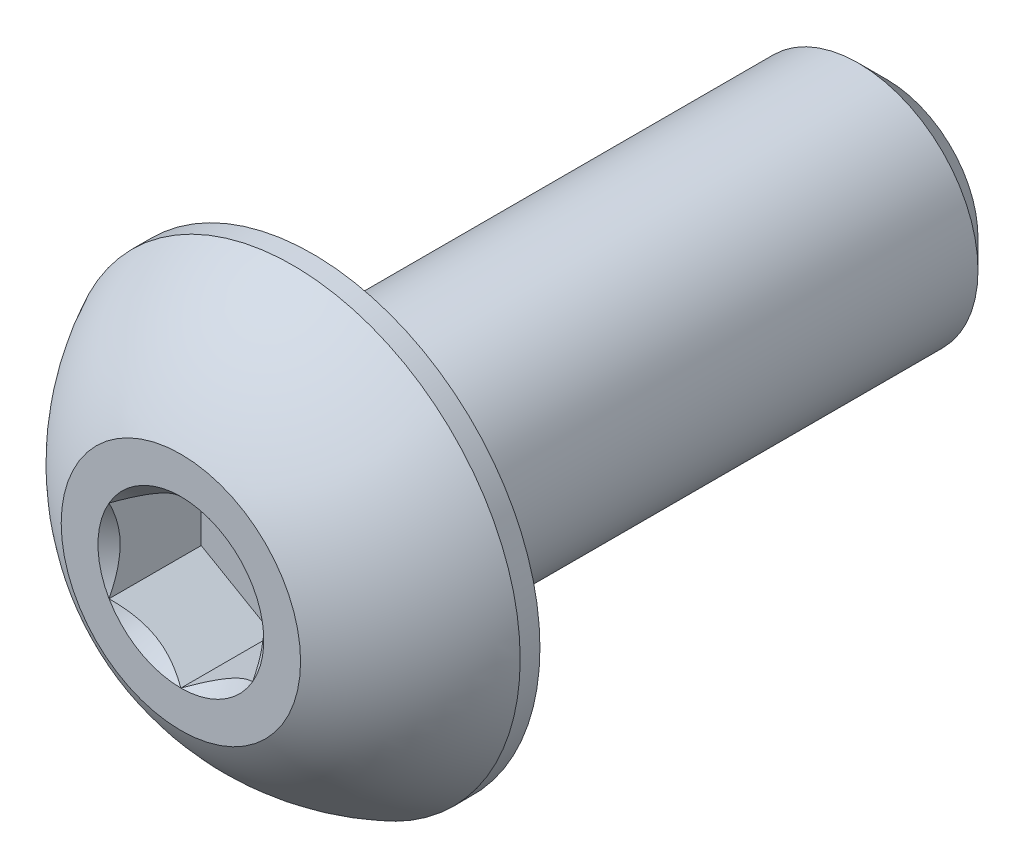
ISO-10303-21;
HEADER;
FILE_DESCRIPTION(('STEP AP214'),'2;1');
FILE_NAME('part.step','',(''),(''),'','','');
FILE_SCHEMA(('AUTOMOTIVE_DESIGN { 1 0 10303 214 1 1 1 1 }'));
ENDSEC;
DATA;
#1=APPLICATION_CONTEXT('core data for automotive mechanical design processes');
#2=APPLICATION_PROTOCOL_DEFINITION('international standard','automotive_design',2000,#1);
#3=PRODUCT_CONTEXT('',#1,'mechanical');
#4=PRODUCT('Part','Part','',(#3));
#5=PRODUCT_RELATED_PRODUCT_CATEGORY('part','',(#4));
#6=PRODUCT_DEFINITION_FORMATION('','',#4);
#7=PRODUCT_DEFINITION_CONTEXT('part definition',#1,'design');
#8=PRODUCT_DEFINITION('design','',#6,#7);
#9=PRODUCT_DEFINITION_SHAPE('','',#8);
#10=(LENGTH_UNIT() NAMED_UNIT(*) SI_UNIT(.MILLI.,.METRE.));
#11=(NAMED_UNIT(*) PLANE_ANGLE_UNIT() SI_UNIT($,.RADIAN.));
#12=(NAMED_UNIT(*) SI_UNIT($,.STERADIAN.) SOLID_ANGLE_UNIT());
#13=UNCERTAINTY_MEASURE_WITH_UNIT(LENGTH_MEASURE(1.E-05),#10,'distance_accuracy_value','');
#14=(GEOMETRIC_REPRESENTATION_CONTEXT(3) GLOBAL_UNCERTAINTY_ASSIGNED_CONTEXT((#13)) GLOBAL_UNIT_ASSIGNED_CONTEXT((#10,
#11,#12)) REPRESENTATION_CONTEXT('',''));
#15=CARTESIAN_POINT('',(0.,0.,0.));
#16=DIRECTION('',(0.,0.,1.));
#17=DIRECTION('',(1.,0.,0.));
#18=AXIS2_PLACEMENT_3D('',#15,#16,#17);
#19=CARTESIAN_POINT('',(0.,-2.50000000000001,-14.75));
#20=DIRECTION('',(0.,0.,-1.));
#21=DIRECTION('',(0.,1.,0.));
#22=AXIS2_PLACEMENT_3D('',#19,#20,#21);
#23=PLANE('',#22);
#24=CARTESIAN_POINT('',(0.,0.,-14.75));
#25=DIRECTION('',(0.,0.,-1.));
#26=DIRECTION('',(0.,1.,0.));
#27=AXIS2_PLACEMENT_3D('',#24,#25,#26);
#28=CIRCLE('',#27,1.90000000000001);
#29=CARTESIAN_POINT('',(0.,1.90000000000001,-14.75));
#30=VERTEX_POINT('',#29);
#31=EDGE_CURVE('E173',#30,#30,#28,.T.);
#32=ORIENTED_EDGE('',*,*,#31,.T.);
#33=EDGE_LOOP('',(#32));
#34=FACE_BOUND('',#33,.T.);
#35=ADVANCED_FACE('F34',(#34),#23,.T.);
#36=CARTESIAN_POINT('',(0.,0.,-14.75));
#37=DIRECTION('',(0.,0.,-1.));
#38=DIRECTION('',(0.,1.,0.));
#39=AXIS2_PLACEMENT_3D('',#36,#37,#38);
#40=CYLINDRICAL_SURFACE('',#39,2.50000000000001);
#41=CARTESIAN_POINT('',(0.,0.,-14.15));
#42=DIRECTION('',(0.,0.,-1.));
#43=DIRECTION('',(0.,1.,0.));
#44=AXIS2_PLACEMENT_3D('',#41,#42,#43);
#45=CIRCLE('',#44,2.50000000000001);
#46=CARTESIAN_POINT('',(0.,2.5,-14.15));
#47=VERTEX_POINT('',#46);
#48=EDGE_CURVE('E47',#47,#47,#45,.F.);
#49=ORIENTED_EDGE('',*,*,#48,.T.);
#50=EDGE_LOOP('',(#49));
#51=FACE_BOUND('',#50,.T.);
#52=CARTESIAN_POINT('',(0.,0.,-2.75));
#53=DIRECTION('',(0.,0.,1.));
#54=DIRECTION('',(1.,0.,0.));
#55=AXIS2_PLACEMENT_3D('',#52,#53,#54);
#56=CIRCLE('',#55,2.50000000000001);
#57=CARTESIAN_POINT('',(2.50000000000001,0.,-2.75));
#58=VERTEX_POINT('',#57);
#59=EDGE_CURVE('E170',#58,#58,#56,.F.);
#60=ORIENTED_EDGE('',*,*,#59,.T.);
#61=EDGE_LOOP('',(#60));
#62=FACE_BOUND('',#61,.T.);
#63=ADVANCED_FACE('F178',(#51,#62),#40,.T.);
#64=CARTESIAN_POINT('',(0.,0.,-14.75));
#65=DIRECTION('',(0.,0.,1.));
#66=DIRECTION('',(0.,-1.,0.));
#67=AXIS2_PLACEMENT_3D('',#64,#65,#66);
#68=CONICAL_SURFACE('',#67,1.90000000000001,0.785398163397447);
#69=ORIENTED_EDGE('',*,*,#48,.F.);
#70=EDGE_LOOP('',(#69));
#71=FACE_BOUND('',#70,.T.);
#72=ORIENTED_EDGE('',*,*,#31,.F.);
#73=EDGE_LOOP('',(#72));
#74=FACE_BOUND('',#73,.T.);
#75=ADVANCED_FACE('F36',(#71,#74),#68,.T.);
#76=CARTESIAN_POINT('',(0.,0.,-4.65805481283422));
#77=DIRECTION('',(0.,0.,1.));
#78=DIRECTION('',(0.,-1.,0.));
#79=AXIS2_PLACEMENT_3D('',#76,#77,#78);
#80=SPHERICAL_SURFACE('',#79,5.28653711226622);
#81=CARTESIAN_POINT('',(0.,0.,0.));
#82=DIRECTION('',(0.,0.,1.));
#83=DIRECTION('',(1.,0.,0.));
#84=AXIS2_PLACEMENT_3D('',#81,#82,#83);
#85=CIRCLE('',#84,2.5);
#86=CARTESIAN_POINT('',(0.,-2.50000000000001,0.));
#87=VERTEX_POINT('',#86);
#88=EDGE_CURVE('E167',#87,#87,#85,.T.);
#89=CARTESIAN_POINT('',(0.,0.,-2.3375));
#90=DIRECTION('',(0.,0.,1.));
#91=DIRECTION('',(1.,0.,0.));
#92=AXIS2_PLACEMENT_3D('',#89,#90,#91);
#93=CIRCLE('',#92,4.75);
#94=CARTESIAN_POINT('',(0.,-4.75,-2.3375));
#95=VERTEX_POINT('',#94);
#96=EDGE_CURVE('E161',#95,#95,#93,.T.);
#97=CARTESIAN_POINT('',(0.,-2.50000000000001,0.));
#98=CARTESIAN_POINT('',(0.,-2.53026679982018,-0.0162442824556099));
#99=CARTESIAN_POINT('',(0.,-2.56037522904968,-0.0327836412064137));
#100=CARTESIAN_POINT('',(0.,-2.62026400427658,-0.066446051882188));
#101=CARTESIAN_POINT('',(0.,-2.65004435027397,-0.0835691038071585));
#102=CARTESIAN_POINT('',(0.,-2.70926561698584,-0.118392441415041));
#103=CARTESIAN_POINT('',(0.,-2.73870653770033,-0.136092727097952));
#104=CARTESIAN_POINT('',(0.,-2.79723777417104,-0.172063794044946));
#105=CARTESIAN_POINT('',(0.,-2.82632808992726,-0.190334575309028));
#106=CARTESIAN_POINT('',(0.,-2.8841470610759,-0.227439694392677));
#107=CARTESIAN_POINT('',(0.,-2.91287571646831,-0.246274032212245));
#108=CARTESIAN_POINT('',(0.,-2.96996045130294,-0.284499106978589));
#109=CARTESIAN_POINT('',(0.,-2.99831653074515,-0.303889843925366));
#110=CARTESIAN_POINT('',(0.,-3.05464533901892,-0.343220349244855));
#111=CARTESIAN_POINT('',(0.,-3.08261806785047,-0.363160117617568));
#112=CARTESIAN_POINT('',(0.,-3.13816954607727,-0.403581109164591));
#113=CARTESIAN_POINT('',(0.,-3.16574829547251,-0.424062332338902));
#114=CARTESIAN_POINT('',(0.,-3.22050133565615,-0.465558451209039));
#115=CARTESIAN_POINT('',(0.,-3.24767562644455,-0.486573346904866));
#116=CARTESIAN_POINT('',(0.,-3.30160942393942,-0.529128825735186));
#117=CARTESIAN_POINT('',(0.,-3.32836893064589,-0.550669408869679));
#118=CARTESIAN_POINT('',(0.,-3.38146299210494,-0.594268077753709));
#119=CARTESIAN_POINT('',(0.,-3.40779754685753,-0.616326163503247));
#120=CARTESIAN_POINT('',(0.,-3.46003169800773,-0.660951456155511));
#121=CARTESIAN_POINT('',(0.,-3.48593129440535,-0.683518663058238));
#122=CARTESIAN_POINT('',(0.,-3.53728568771642,-0.72915362310351));
#123=CARTESIAN_POINT('',(0.,-3.56274048462986,-0.752221376246056));
#124=CARTESIAN_POINT('',(0.,-3.61319560685493,-0.79884866366378));
#125=CARTESIAN_POINT('',(0.,-3.63819593216655,-0.822408197938958));
#126=CARTESIAN_POINT('',(0.,-3.68773261175691,-0.870010095651584));
#127=CARTESIAN_POINT('',(0.,-3.71226896603565,-0.894052459089031));
#128=CARTESIAN_POINT('',(0.,-3.76086838042534,-0.942610879694118));
#129=CARTESIAN_POINT('',(0.,-3.78493144053629,-0.967126936861757));
#130=CARTESIAN_POINT('',(0.,-3.83257512329416,-1.01662342950466));
#131=CARTESIAN_POINT('',(0.,-3.85615574594109,-1.04160386497992));
#132=CARTESIAN_POINT('',(0.,-3.90282559378753,-1.0920196223646));
#133=CARTESIAN_POINT('',(0.,-3.92591481898706,-1.11745494427402));
#134=CARTESIAN_POINT('',(0.,-3.97159309867276,-1.1687708098093));
#135=CARTESIAN_POINT('',(0.,-3.99418215315894,-1.19465135343517));
#136=CARTESIAN_POINT('',(0.,-4.03885150820303,-1.24684782851374));
#137=CARTESIAN_POINT('',(0.,-4.06093180876094,-1.27316375996643));
#138=CARTESIAN_POINT('',(0.,-4.10457526604591,-1.32622101137371));
#139=CARTESIAN_POINT('',(0.,-4.12613842277298,-1.3529623313283));
#140=CARTESIAN_POINT('',(0.,-4.16873939899418,-1.40686019877854));
#141=CARTESIAN_POINT('',(0.,-4.1897772184883,-1.4340167462742));
#142=CARTESIAN_POINT('',(0.,-4.23131952645464,-1.488734750071));
#143=CARTESIAN_POINT('',(0.,-4.25182401492686,-1.51629620637214));
#144=CARTESIAN_POINT('',(0.,-4.29229186971308,-1.5718135551894));
#145=CARTESIAN_POINT('',(0.,-4.31225523602708,-1.59976944770551));
#146=CARTESIAN_POINT('',(0.,-4.35163326096594,-1.65606504649041));
#147=CARTESIAN_POINT('',(0.,-4.3710479195908,-1.6844047527592));
#148=CARTESIAN_POINT('',(0.,-4.40932115213664,-1.74145721073709));
#149=CARTESIAN_POINT('',(0.,-4.42817972605763,-1.77016996244618));
#150=CARTESIAN_POINT('',(0.,-4.46533362339398,-1.82795760128832));
#151=CARTESIAN_POINT('',(0.,-4.48362894680935,-1.85703248842136));
#152=CARTESIAN_POINT('',(0.,-4.51964939166499,-1.91553335033324));
#153=CARTESIAN_POINT('',(0.,-4.53737451310527,-1.94495932511209));
#154=CARTESIAN_POINT('',(0.,-4.57224781803529,-2.00415118173237));
#155=CARTESIAN_POINT('',(0.,-4.58939600152503,-2.03391706357382));
#156=CARTESIAN_POINT('',(0.,-4.62310891815402,-2.09377742234707));
#157=CARTESIAN_POINT('',(0.,-4.63967365129327,-2.12387189927887));
#158=CARTESIAN_POINT('',(0.,-4.67221336026297,-2.18437801974018));
#159=CARTESIAN_POINT('',(0.,-4.68818833609342,-2.21478966326969));
#160=CARTESIAN_POINT('',(0.,-4.71954250823692,-2.27591853680649));
#161=CARTESIAN_POINT('',(0.,-4.73492170454996,-2.30663576681378));
#162=CARTESIAN_POINT('',(0.,-4.75,-2.3375));
#163=B_SPLINE_CURVE_WITH_KNOTS('',3,(#97,#98,#99,#100,#101,#102,#103,#104,#105,#106,#107,#108,
#109,#110,#111,#112,#113,#114,#115,#116,#117,#118,#119,#120,#121,#122,#123,#124,#125,#126,#127,
#128,#129,#130,#131,#132,#133,#134,#135,#136,#137,#138,#139,#140,#141,#142,#143,#144,#145,#146,
#147,#148,#149,#150,#151,#152,#153,#154,#155,#156,#157,#158,#159,#160,#161,#162),.UNSPECIFIED.,
.F.,.F.,(4,2,2,2,2,2,2,2,2,2,2,2,2,2,2,2,2,2,2,2,2,2,2,2,2,2,2,2,2,2,2,2,4),(0.,
0.10304982363783,0.206099647275661,0.309149470913491,0.412199294551321,0.515249118189151,
0.618298941826981,0.721348765464812,0.824398589102642,0.927448412740472,1.0304982363783,
1.13354806001613,1.23659788365396,1.33964770729179,1.44269753092962,1.54574735456745,
1.64879717820528,1.75184700184311,1.85489682548094,1.95794664911877,2.0609964727566,
2.16404629639444,2.26709612003227,2.3701459436701,2.47319576730793,2.57624559094576,
2.67929541458359,2.78234523822142,2.88539506185925,2.98844488549708,3.09149470913491,
3.19454453277274,3.29759435641057),.UNSPECIFIED.);
#164=EDGE_CURVE('BSEAM183',#87,#95,#163,.T.);
#165=ORIENTED_EDGE('',*,*,#88,.F.);
#166=ORIENTED_EDGE('',*,*,#96,.T.);
#167=ORIENTED_EDGE('',*,*,#164,.T.);
#168=ORIENTED_EDGE('',*,*,#164,.F.);
#169=EDGE_LOOP('',(#165,#167,#166,#168));
#170=FACE_BOUND('',#169,.T.);
#171=ADVANCED_FACE('F183',(#170),#80,.T.);
#172=CARTESIAN_POINT('',(0.,-2.5,0.));
#173=DIRECTION('',(0.,0.,-1.));
#174=DIRECTION('',(-1.,0.,0.));
#175=AXIS2_PLACEMENT_3D('',#172,#173,#174);
#176=PLANE('',#175);
#177=CARTESIAN_POINT('',(0.,0.,0.));
#178=DIRECTION('',(0.,0.,1.));
#179=DIRECTION('',(1.,0.,0.));
#180=AXIS2_PLACEMENT_3D('',#177,#178,#179);
#181=CIRCLE('',#180,1.73205080756888);
#182=CARTESIAN_POINT('',(-1.5,0.866025403784438,0.));
#183=VERTEX_POINT('',#182);
#184=CARTESIAN_POINT('',(-1.5,-0.866025403784439,0.));
#185=VERTEX_POINT('',#184);
#186=EDGE_CURVE('E60',#183,#185,#181,.T.);
#187=ORIENTED_EDGE('',*,*,#186,.F.);
#188=CARTESIAN_POINT('',(0.,1.73205080756888,0.));
#189=VERTEX_POINT('',#188);
#190=EDGE_CURVE('E132',#189,#183,#181,.T.);
#191=ORIENTED_EDGE('',*,*,#190,.F.);
#192=CARTESIAN_POINT('',(1.5,0.866025403784439,0.));
#193=VERTEX_POINT('',#192);
#194=EDGE_CURVE('E129',#193,#189,#181,.T.);
#195=ORIENTED_EDGE('',*,*,#194,.F.);
#196=CARTESIAN_POINT('',(1.5,-0.866025403784439,0.));
#197=VERTEX_POINT('',#196);
#198=EDGE_CURVE('E100',#197,#193,#181,.T.);
#199=ORIENTED_EDGE('',*,*,#198,.F.);
#200=CARTESIAN_POINT('',(0.,-1.73205080756888,0.));
#201=VERTEX_POINT('',#200);
#202=EDGE_CURVE('E92',#201,#197,#181,.T.);
#203=ORIENTED_EDGE('',*,*,#202,.F.);
#204=EDGE_CURVE('E53',#185,#201,#181,.T.);
#205=ORIENTED_EDGE('',*,*,#204,.F.);
#206=EDGE_LOOP('',(#187,#191,#195,#199,#203,#205));
#207=FACE_BOUND('',#206,.T.);
#208=ORIENTED_EDGE('',*,*,#88,.T.);
#209=EDGE_LOOP('',(#208));
#210=FACE_BOUND('',#209,.T.);
#211=ADVANCED_FACE('F126',(#207,#210),#176,.F.);
#212=CARTESIAN_POINT('',(0.,-4.75,-2.75));
#213=DIRECTION('',(0.,0.,1.));
#214=DIRECTION('',(1.,0.,0.));
#215=AXIS2_PLACEMENT_3D('',#212,#213,#214);
#216=PLANE('',#215);
#217=ORIENTED_EDGE('',*,*,#59,.F.);
#218=EDGE_LOOP('',(#217));
#219=FACE_BOUND('',#218,.T.);
#220=CARTESIAN_POINT('',(0.,0.,-2.75));
#221=DIRECTION('',(0.,0.,1.));
#222=DIRECTION('',(1.,0.,0.));
#223=AXIS2_PLACEMENT_3D('',#220,#221,#222);
#224=CIRCLE('',#223,4.75);
#225=CARTESIAN_POINT('',(4.75,0.,-2.75));
#226=VERTEX_POINT('',#225);
#227=EDGE_CURVE('E164',#226,#226,#224,.T.);
#228=ORIENTED_EDGE('',*,*,#227,.F.);
#229=EDGE_LOOP('',(#228));
#230=FACE_BOUND('',#229,.T.);
#231=ADVANCED_FACE('F197',(#219,#230),#216,.F.);
#232=CARTESIAN_POINT('',(0.,0.,0.));
#233=DIRECTION('',(0.,0.,1.));
#234=DIRECTION('',(1.,0.,0.));
#235=AXIS2_PLACEMENT_3D('',#232,#233,#234);
#236=CYLINDRICAL_SURFACE('',#235,4.75);
#237=ORIENTED_EDGE('',*,*,#96,.F.);
#238=EDGE_LOOP('',(#237));
#239=FACE_BOUND('',#238,.T.);
#240=ORIENTED_EDGE('',*,*,#227,.T.);
#241=EDGE_LOOP('',(#240));
#242=FACE_BOUND('',#241,.T.);
#243=ADVANCED_FACE('F200',(#239,#242),#236,.T.);
#244=CARTESIAN_POINT('',(0.,0.,0.));
#245=DIRECTION('',(0.,0.,1.));
#246=DIRECTION('',(1.,0.,0.));
#247=AXIS2_PLACEMENT_3D('',#244,#245,#246);
#248=CONICAL_SURFACE('',#247,1.73205080756888,0.78539816339745);
#249=ORIENTED_EDGE('',*,*,#198,.T.);
#250=CARTESIAN_POINT('',(1.5,-1.72720812969692,0.555578516270791));
#251=CARTESIAN_POINT('',(1.5,-1.68515175699268,0.523829907857426));
#252=CARTESIAN_POINT('',(1.5,-1.64286104748673,0.492392593807383));
#253=CARTESIAN_POINT('',(1.5,-1.55771581035942,0.430269087556409));
#254=CARTESIAN_POINT('',(1.5,-1.51486114386668,0.399583085892202));
#255=CARTESIAN_POINT('',(1.5,-1.3846813415127,0.30840719242716));
#256=CARTESIAN_POINT('',(1.5,-1.29637976071654,0.249288343426773));
#257=CARTESIAN_POINT('',(1.5,-1.11121478730467,0.133230996316504));
#258=CARTESIAN_POINT('',(1.5,-1.01415038238167,0.0766095587330078));
#259=CARTESIAN_POINT('',(1.5,-0.815173408897605,-0.0269631187343472));
#260=CARTESIAN_POINT('',(1.5,-0.713278669253285,-0.0739469584583305));
#261=CARTESIAN_POINT('',(1.5,-0.560333774943111,-0.13142733156917));
#262=CARTESIAN_POINT('',(1.5,-0.511547982948042,-0.147924612242751));
#263=CARTESIAN_POINT('',(1.5,-0.412798620136866,-0.177002487072996));
#264=CARTESIAN_POINT('',(1.5,-0.362834968437562,-0.189582811405981));
#265=CARTESIAN_POINT('',(1.5,-0.262863235444982,-0.20996380585323));
#266=CARTESIAN_POINT('',(1.5,-0.212872113808022,-0.21784636725402));
#267=CARTESIAN_POINT('',(1.5,-0.112355243569545,-0.228677936030997));
#268=CARTESIAN_POINT('',(1.5,-0.0618295883726279,-0.231627791475649));
#269=CARTESIAN_POINT('',(1.5,0.037429173332384,-0.23237514227515));
#270=CARTESIAN_POINT('',(1.5,0.0861609672002989,-0.230355266441925));
#271=CARTESIAN_POINT('',(1.5,0.183206937768827,-0.221677447103242));
#272=CARTESIAN_POINT('',(1.5,0.231521073438269,-0.215019053031544));
#273=CARTESIAN_POINT('',(1.5,0.328199853425435,-0.197314755877433));
#274=CARTESIAN_POINT('',(1.5,0.376550616310328,-0.186194188742961));
#275=CARTESIAN_POINT('',(1.5,0.472195697125598,-0.160156585951288));
#276=CARTESIAN_POINT('',(1.5,0.51949010309274,-0.145239867959065));
#277=CARTESIAN_POINT('',(1.5,0.668391282696624,-0.0926647764039276));
#278=CARTESIAN_POINT('',(1.5,0.767878709508552,-0.0490187125280247));
#279=CARTESIAN_POINT('',(1.5,0.962179866690724,0.048022994593097));
#280=CARTESIAN_POINT('',(1.5,1.05697519961444,0.101453665089533));
#281=CARTESIAN_POINT('',(1.5,1.23814273533383,0.211685852004558));
#282=CARTESIAN_POINT('',(1.5,1.3246994218129,0.268187920698596));
#283=CARTESIAN_POINT('',(1.5,1.45222331290673,0.355534301578659));
#284=CARTESIAN_POINT('',(1.5,1.49418091978756,0.384957758680043));
#285=CARTESIAN_POINT('',(1.5,1.57752272931476,0.444582821830463));
#286=CARTESIAN_POINT('',(1.5,1.61890708647354,0.474784211664437));
#287=CARTESIAN_POINT('',(1.5,1.66005278019494,0.505308178609455));
#288=B_SPLINE_CURVE_WITH_KNOTS('',3,(#250,#251,#252,#253,#254,#255,#256,#257,#258,#259,#260,
#261,#262,#263,#264,#265,#266,#267,#268,#269,#270,#271,#272,#273,#274,#275,#276,#277,#278,#279,
#280,#281,#282,#283,#284,#285,#286,#287),.UNSPECIFIED.,.F.,.F.,(4,2,2,2,2,2,2,2,2,2,2,2,2,2,2,2,
2,2,4),(0.,0.158079548982668,0.316198780993942,0.634850417346958,0.97169031136151,
1.30737131660667,1.46173961127089,1.61611853740677,1.7677210142141,1.91929742368538,
2.065387412096,2.21149159305544,2.36014984633872,2.50879566386709,2.83376031422673,
3.15991186985652,3.46985601802197,3.62358896039974,3.7772796264207),.UNSPECIFIED.);
#289=EDGE_CURVE('E11',#197,#193,#288,.T.);
#290=ORIENTED_EDGE('',*,*,#289,.F.);
#291=EDGE_LOOP('',(#249,#290));
#292=FACE_BOUND('',#291,.T.);
#293=ADVANCED_FACE('F104',(#292),#248,.F.);
#294=ORIENTED_EDGE('',*,*,#194,.T.);
#295=CARTESIAN_POINT('',(1.5002,0.865909933730601,0.000115481600073358));
#296=CARTESIAN_POINT('',(1.44863220926292,0.895682611594166,-0.0296345239326722));
#297=CARTESIAN_POINT('',(1.3962020823348,0.925953159489765,-0.0576375160896872));
#298=CARTESIAN_POINT('',(1.2892909659444,0.987678321317123,-0.108910769559857));
#299=CARTESIAN_POINT('',(1.23479980418534,1.01913880822717,-0.132152494955627));
#300=CARTESIAN_POINT('',(1.12492091864275,1.08257741237344,-0.17196627100778));
#301=CARTESIAN_POINT('',(1.0695611909048,1.11453936608521,-0.188638414329103));
#302=CARTESIAN_POINT('',(0.95762274252285,1.1791670593912,-0.214325543181896));
#303=CARTESIAN_POINT('',(0.901047443446992,1.21183082354213,-0.223359709521134));
#304=CARTESIAN_POINT('',(0.80354461048356,1.26812411040032,-0.231510918773148));
#305=CARTESIAN_POINT('',(0.762743091719534,1.29168087824208,-0.232717747010784));
#306=CARTESIAN_POINT('',(0.681212030384142,1.33875285845138,-0.230685942837733));
#307=CARTESIAN_POINT('',(0.64048250568537,1.36226806050018,-0.227446329251693));
#308=CARTESIAN_POINT('',(0.559415597836584,1.40907206156905,-0.216708014018038));
#309=CARTESIAN_POINT('',(0.519078615401712,1.43236062923612,-0.209205346981267));
#310=CARTESIAN_POINT('',(0.43908166308597,1.47854689118996,-0.19034838807171));
#311=CARTESIAN_POINT('',(0.399421991483793,1.50144441326545,-0.178992442981415));
#312=CARTESIAN_POINT('',(0.297836865225515,1.56009461325633,-0.145278352407329));
#313=CARTESIAN_POINT('',(0.236541446290311,1.59548353987866,-0.120378150906633));
#314=CARTESIAN_POINT('',(0.146414371536687,1.64751843074894,-0.078343346728424));
#315=CARTESIAN_POINT('',(0.116714860092282,1.66466545167617,-0.0635748464409041));
#316=CARTESIAN_POINT('',(0.0578620986162489,1.69864410935691,-0.0326894340598314));
#317=CARTESIAN_POINT('',(0.0287085957793626,1.71547589206761,-0.0165731658782897));
#318=CARTESIAN_POINT('',(-0.000200000000000189,1.73216627762271,0.000115481600073298));
#319=B_SPLINE_CURVE_WITH_KNOTS('',3,(#295,#296,#297,#298,#299,#300,#301,#302,#303,#304,#305,
#306,#307,#308,#309,#310,#311,#312,#313,#314,#315,#316,#317,#318),.UNSPECIFIED.,.F.,.F.,(4,2,2,
2,2,2,2,2,2,2,2,4),(0.,0.199829143693305,0.400822987382388,0.59862372053818,0.795926240188888,
0.93711306795988,1.07833105577193,1.21968061668222,1.36109089931054,1.58570969637565,
1.69770705470964,1.80965120737194),.UNSPECIFIED.);
#320=EDGE_CURVE('E131',#193,#189,#319,.T.);
#321=ORIENTED_EDGE('',*,*,#320,.F.);
#322=EDGE_LOOP('',(#294,#321));
#323=FACE_BOUND('',#322,.T.);
#324=ADVANCED_FACE('F280',(#323),#248,.F.);
#325=ORIENTED_EDGE('',*,*,#190,.T.);
#326=CARTESIAN_POINT('',(0.000199999999999634,1.73216627762272,0.000115481600073681));
#327=CARTESIAN_POINT('',(-0.0513677907370761,1.70239359975915,-0.029634523932672));
#328=CARTESIAN_POINT('',(-0.103797917665201,1.67212305186355,-0.0576375160896873));
#329=CARTESIAN_POINT('',(-0.210709034055597,1.61039789003619,-0.108910769559858));
#330=CARTESIAN_POINT('',(-0.265200195814661,1.57893740312614,-0.132152494955627));
#331=CARTESIAN_POINT('',(-0.375079081357249,1.51549879897987,-0.17196627100778));
#332=CARTESIAN_POINT('',(-0.4304388090952,1.4835368452681,-0.188638414329104));
#333=CARTESIAN_POINT('',(-0.542377257477151,1.41890915196211,-0.214325543181897));
#334=CARTESIAN_POINT('',(-0.598952556553009,1.38624538781118,-0.223359709521134));
#335=CARTESIAN_POINT('',(-0.696455389516441,1.32995210095299,-0.231510918773148));
#336=CARTESIAN_POINT('',(-0.737256908280467,1.30639533311124,-0.232717747010783));
#337=CARTESIAN_POINT('',(-0.818787969615859,1.25932335290193,-0.230685942837733));
#338=CARTESIAN_POINT('',(-0.859517494314631,1.23580815085313,-0.227446329251693));
#339=CARTESIAN_POINT('',(-0.940584402163417,1.18900414978427,-0.216708014018038));
#340=CARTESIAN_POINT('',(-0.980921384598289,1.16571558211719,-0.209205346981267));
#341=CARTESIAN_POINT('',(-1.06091833691403,1.11952932016335,-0.19034838807171));
#342=CARTESIAN_POINT('',(-1.10057800851621,1.09663179808786,-0.178992442981415));
#343=CARTESIAN_POINT('',(-1.20216313477449,1.03798159809698,-0.145278352407329));
#344=CARTESIAN_POINT('',(-1.26345855370969,1.00259267147465,-0.120378150906633));
#345=CARTESIAN_POINT('',(-1.35358562846331,0.950557780604374,-0.0783433467284239));
#346=CARTESIAN_POINT('',(-1.38328513990772,0.933410759677147,-0.0635748464409042));
#347=CARTESIAN_POINT('',(-1.44213790138375,0.899432101996406,-0.0326894340598318));
#348=CARTESIAN_POINT('',(-1.47129140422064,0.882600319285709,-0.0165731658782901));
#349=CARTESIAN_POINT('',(-1.5002,0.8659099337306,0.000115481600073071));
#350=B_SPLINE_CURVE_WITH_KNOTS('',3,(#326,#327,#328,#329,#330,#331,#332,#333,#334,#335,#336,
#337,#338,#339,#340,#341,#342,#343,#344,#345,#346,#347,#348,#349),.UNSPECIFIED.,.F.,.F.,(4,2,2,
2,2,2,2,2,2,2,2,4),(0.,0.199829143693305,0.400822987382389,0.598623720538181,0.79592624018889,
0.937113067959882,1.07833105577193,1.21968061668222,1.36109089931055,1.58570969637566,
1.69770705470964,1.80965120737194),.UNSPECIFIED.);
#351=EDGE_CURVE('E136',#189,#183,#350,.T.);
#352=ORIENTED_EDGE('',*,*,#351,.F.);
#353=EDGE_LOOP('',(#325,#352));
#354=FACE_BOUND('',#353,.T.);
#355=ADVANCED_FACE('F139',(#354),#248,.F.);
#356=ORIENTED_EDGE('',*,*,#186,.T.);
#357=CARTESIAN_POINT('',(-1.5,-1.72720812994822,0.555578516460528));
#358=CARTESIAN_POINT('',(-1.5,-1.68515175723693,0.523829908039856));
#359=CARTESIAN_POINT('',(-1.5,-1.64286104772391,0.492392593982516));
#360=CARTESIAN_POINT('',(-1.5,-1.55771581058238,0.430269087716991));
#361=CARTESIAN_POINT('',(-1.5,-1.5148611440825,0.39958308604553));
#362=CARTESIAN_POINT('',(-1.5,-1.38468134170665,0.308407192558587));
#363=CARTESIAN_POINT('',(-1.5,-1.29637976089561,0.249288343543661));
#364=CARTESIAN_POINT('',(-1.5,-1.11121478745132,0.133230996403487));
#365=CARTESIAN_POINT('',(-1.5,-1.01415038251068,0.0766095588047338));
#366=CARTESIAN_POINT('',(-1.5,-0.815173408989816,-0.0269631186909052));
#367=CARTESIAN_POINT('',(-1.5,-0.713278669326361,-0.0739469584279351));
#368=CARTESIAN_POINT('',(-1.5,-0.56033377500179,-0.131427331548458));
#369=CARTESIAN_POINT('',(-1.5,-0.51154798301275,-0.147924612221661));
#370=CARTESIAN_POINT('',(-1.5,-0.412798620213829,-0.17700248705237));
#371=CARTESIAN_POINT('',(-1.5,-0.362834968520751,-0.189582811386198));
#372=CARTESIAN_POINT('',(-1.5,-0.262863235540417,-0.209963805836543));
#373=CARTESIAN_POINT('',(-1.5,-0.212872113909476,-0.21784636723955));
#374=CARTESIAN_POINT('',(-1.5,-0.112355243682833,-0.228677936022322));
#375=CARTESIAN_POINT('',(-1.5,-0.0618295884917315,-0.231627791470552));
#376=CARTESIAN_POINT('',(-1.5,0.0374291732025489,-0.232375142278223));
#377=CARTESIAN_POINT('',(-1.5,0.0861609670655337,-0.23035526644952));
#378=CARTESIAN_POINT('',(-1.5,0.183206937624695,-0.221677447120588));
#379=CARTESIAN_POINT('',(-1.5,0.2315210732897,-0.215019053054117));
#380=CARTESIAN_POINT('',(-1.5,0.328199853268108,-0.197314755910963));
#381=CARTESIAN_POINT('',(-1.5,0.376550616148692,-0.186194188782254));
#382=CARTESIAN_POINT('',(-1.5,0.47219569695576,-0.160156586002233));
#383=CARTESIAN_POINT('',(-1.5,0.519490102919009,-0.145239868015899));
#384=CARTESIAN_POINT('',(-1.5,0.668391282485063,-0.0926647764885235));
#385=CARTESIAN_POINT('',(-1.5,0.767878709264951,-0.0490187126381633));
#386=CARTESIAN_POINT('',(-1.5,0.9621798663855,0.0480229944290594));
#387=CARTESIAN_POINT('',(-1.5,1.05697519927965,0.101453664897119));
#388=CARTESIAN_POINT('',(-1.5,1.23814273494588,0.211685851757829));
#389=CARTESIAN_POINT('',(-1.5,1.32469942140117,0.268187920426179));
#390=CARTESIAN_POINT('',(-1.5,1.45222331245985,0.355534301267841));
#391=CARTESIAN_POINT('',(-1.5,1.49418091932912,0.384957758356527));
#392=CARTESIAN_POINT('',(-1.5,1.5775227288333,0.444582821481566));
#393=CARTESIAN_POINT('',(-1.5,1.6189070859806,0.474784211302857));
#394=CARTESIAN_POINT('',(-1.5,1.66005277969054,0.505308178235208));
#395=B_SPLINE_CURVE_WITH_KNOTS('',3,(#357,#358,#359,#360,#361,#362,#363,#364,#365,#366,#367,
#368,#369,#370,#371,#372,#373,#374,#375,#376,#377,#378,#379,#380,#381,#382,#383,#384,#385,#386,
#387,#388,#389,#390,#391,#392,#393,#394),.UNSPECIFIED.,.F.,.F.,(4,2,2,2,2,2,2,2,2,2,2,2,2,2,2,2,
2,2,4),(0.,0.158079549012758,0.316198781054129,0.634850417468465,0.971690311551781,
1.30737131686505,1.46173961151184,1.61611853763032,1.76772101442095,1.91929742387554,
2.06538741227089,2.21149159321503,2.36014984648185,2.50879566399376,2.83376031423511,
3.15991186974583,3.4698560178094,3.62358896013692,3.77727962610764),.UNSPECIFIED.);
#396=EDGE_CURVE('E143',#183,#185,#395,.F.);
#397=ORIENTED_EDGE('',*,*,#396,.F.);
#398=EDGE_LOOP('',(#356,#397));
#399=FACE_BOUND('',#398,.T.);
#400=ADVANCED_FACE('F274',(#399),#248,.F.);
#401=ORIENTED_EDGE('',*,*,#204,.T.);
#402=CARTESIAN_POINT('',(-1.5002,-0.865909933730601,0.000115481600073575));
#403=CARTESIAN_POINT('',(-1.44863220926292,-0.895682611594166,-0.029634523932672));
#404=CARTESIAN_POINT('',(-1.3962020823348,-0.925953159489765,-0.0576375160896872));
#405=CARTESIAN_POINT('',(-1.2892909659444,-0.987678321317124,-0.108910769559857));
#406=CARTESIAN_POINT('',(-1.23479980418534,-1.01913880822718,-0.132152494955627));
#407=CARTESIAN_POINT('',(-1.12492091864275,-1.08257741237344,-0.17196627100778));
#408=CARTESIAN_POINT('',(-1.0695611909048,-1.11453936608521,-0.188638414329104));
#409=CARTESIAN_POINT('',(-0.957622742522849,-1.1791670593912,-0.214325543181897));
#410=CARTESIAN_POINT('',(-0.901047443446991,-1.21183082354213,-0.223359709521134));
#411=CARTESIAN_POINT('',(-0.803544610483558,-1.26812411040032,-0.231510918773148));
#412=CARTESIAN_POINT('',(-0.762743091719533,-1.29168087824208,-0.232717747010783));
#413=CARTESIAN_POINT('',(-0.681212030384141,-1.33875285845138,-0.230685942837732));
#414=CARTESIAN_POINT('',(-0.640482505685369,-1.36226806050018,-0.227446329251692));
#415=CARTESIAN_POINT('',(-0.559415597836583,-1.40907206156905,-0.216708014018038));
#416=CARTESIAN_POINT('',(-0.519078615401711,-1.43236062923612,-0.209205346981267));
#417=CARTESIAN_POINT('',(-0.439081663085968,-1.47854689118996,-0.190348388071709));
#418=CARTESIAN_POINT('',(-0.399421991483791,-1.50144441326545,-0.178992442981415));
#419=CARTESIAN_POINT('',(-0.297836865225514,-1.56009461325633,-0.145278352407328));
#420=CARTESIAN_POINT('',(-0.23654144629031,-1.59548353987866,-0.120378150906633));
#421=CARTESIAN_POINT('',(-0.146414371536686,-1.64751843074894,-0.0783433467284234));
#422=CARTESIAN_POINT('',(-0.116714860092282,-1.66466545167617,-0.0635748464409035));
#423=CARTESIAN_POINT('',(-0.0578620986162485,-1.69864410935691,-0.0326894340598309));
#424=CARTESIAN_POINT('',(-0.0287085957793622,-1.71547589206761,-0.0165731658782891));
#425=CARTESIAN_POINT('',(0.00020000000000064,-1.73216627762272,0.000115481600073865));
#426=B_SPLINE_CURVE_WITH_KNOTS('',3,(#402,#403,#404,#405,#406,#407,#408,#409,#410,#411,#412,
#413,#414,#415,#416,#417,#418,#419,#420,#421,#422,#423,#424,#425),.UNSPECIFIED.,.F.,.F.,(4,2,2,
2,2,2,2,2,2,2,2,4),(0.,0.199829143693305,0.400822987382389,0.598623720538181,0.79592624018889,
0.937113067959882,1.07833105577193,1.21968061668222,1.36109089931054,1.58570969637566,
1.69770705470964,1.80965120737194),.UNSPECIFIED.);
#427=EDGE_CURVE('E116',#185,#201,#426,.T.);
#428=ORIENTED_EDGE('',*,*,#427,.F.);
#429=EDGE_LOOP('',(#401,#428));
#430=FACE_BOUND('',#429,.T.);
#431=ADVANCED_FACE('F225',(#430),#248,.F.);
#432=ORIENTED_EDGE('',*,*,#202,.T.);
#433=CARTESIAN_POINT('',(-0.000199999999999451,-1.73216627762272,0.000115481600073879));
#434=CARTESIAN_POINT('',(0.0513677907370763,-1.70239359975915,-0.029634523932672));
#435=CARTESIAN_POINT('',(0.103797917665201,-1.67212305186355,-0.0576375160896872));
#436=CARTESIAN_POINT('',(0.210709034055597,-1.61039789003619,-0.108910769559857));
#437=CARTESIAN_POINT('',(0.265200195814662,-1.57893740312614,-0.132152494955627));
#438=CARTESIAN_POINT('',(0.375079081357249,-1.51549879897987,-0.17196627100778));
#439=CARTESIAN_POINT('',(0.4304388090952,-1.4835368452681,-0.188638414329103));
#440=CARTESIAN_POINT('',(0.542377257477151,-1.41890915196211,-0.214325543181896));
#441=CARTESIAN_POINT('',(0.598952556553009,-1.38624538781118,-0.223359709521134));
#442=CARTESIAN_POINT('',(0.696455389516441,-1.32995210095299,-0.231510918773148));
#443=CARTESIAN_POINT('',(0.737256908280467,-1.30639533311124,-0.232717747010783));
#444=CARTESIAN_POINT('',(0.818787969615859,-1.25932335290193,-0.230685942837733));
#445=CARTESIAN_POINT('',(0.85951749431463,-1.23580815085313,-0.227446329251692));
#446=CARTESIAN_POINT('',(0.940584402163416,-1.18900414978427,-0.216708014018038));
#447=CARTESIAN_POINT('',(0.980921384598289,-1.16571558211719,-0.209205346981267));
#448=CARTESIAN_POINT('',(1.06091833691403,-1.11952932016335,-0.19034838807171));
#449=CARTESIAN_POINT('',(1.10057800851621,-1.09663179808786,-0.178992442981415));
#450=CARTESIAN_POINT('',(1.20216313477449,-1.03798159809698,-0.145278352407328));
#451=CARTESIAN_POINT('',(1.26345855370969,-1.00259267147465,-0.120378150906633));
#452=CARTESIAN_POINT('',(1.35358562846331,-0.950557780604374,-0.0783433467284238));
#453=CARTESIAN_POINT('',(1.38328513990772,-0.933410759677147,-0.063574846440904));
#454=CARTESIAN_POINT('',(1.44213790138375,-0.899432101996407,-0.0326894340598316));
#455=CARTESIAN_POINT('',(1.47129140422064,-0.88260031928571,-0.0165731658782899));
#456=CARTESIAN_POINT('',(1.5002,-0.865909933730601,0.000115481600073133));
#457=B_SPLINE_CURVE_WITH_KNOTS('',3,(#433,#434,#435,#436,#437,#438,#439,#440,#441,#442,#443,
#444,#445,#446,#447,#448,#449,#450,#451,#452,#453,#454,#455,#456),.UNSPECIFIED.,.F.,.F.,(4,2,2,
2,2,2,2,2,2,2,2,4),(0.,0.199829143693305,0.400822987382389,0.598623720538181,0.795926240188889,
0.937113067959881,1.07833105577193,1.21968061668222,1.36109089931054,1.58570969637565,
1.69770705470964,1.80965120737194),.UNSPECIFIED.);
#458=EDGE_CURVE('E96',#201,#197,#457,.T.);
#459=ORIENTED_EDGE('',*,*,#458,.F.);
#460=EDGE_LOOP('',(#432,#459));
#461=FACE_BOUND('',#460,.T.);
#462=ADVANCED_FACE('F94',(#461),#248,.F.);
#463=CARTESIAN_POINT('',(1.5,-0.866025403784438,-1.925));
#464=DIRECTION('',(0.,0.,1.));
#465=DIRECTION('',(1.,0.,0.));
#466=AXIS2_PLACEMENT_3D('',#463,#464,#465);
#467=PLANE('',#466);
#468=DIRECTION('',(0.866025403784438,0.5,0.));
#469=VECTOR('',#468,1.);
#470=CARTESIAN_POINT('',(0.,-1.73205080756888,-1.925));
#471=LINE('',#470,#469);
#472=CARTESIAN_POINT('',(0.,-1.73205080756888,-1.925));
#473=VERTEX_POINT('',#472);
#474=CARTESIAN_POINT('',(1.5,-0.866025403784438,-1.925));
#475=VERTEX_POINT('',#474);
#476=EDGE_CURVE('E115',#473,#475,#471,.T.);
#477=ORIENTED_EDGE('',*,*,#476,.T.);
#478=DIRECTION('',(0.,1.,0.));
#479=VECTOR('',#478,1.);
#480=CARTESIAN_POINT('',(1.5,-0.866025403784438,-1.925));
#481=LINE('',#480,#479);
#482=CARTESIAN_POINT('',(1.5,0.866025403784439,-1.925));
#483=VERTEX_POINT('',#482);
#484=EDGE_CURVE('E120',#475,#483,#481,.T.);
#485=ORIENTED_EDGE('',*,*,#484,.T.);
#486=DIRECTION('',(-0.866025403784439,0.5,0.));
#487=VECTOR('',#486,1.);
#488=CARTESIAN_POINT('',(1.5,0.866025403784439,-1.925));
#489=LINE('',#488,#487);
#490=CARTESIAN_POINT('',(0.,1.73205080756888,-1.925));
#491=VERTEX_POINT('',#490);
#492=EDGE_CURVE('E264',#483,#491,#489,.T.);
#493=ORIENTED_EDGE('',*,*,#492,.T.);
#494=DIRECTION('',(-0.866025403784438,-0.5,0.));
#495=VECTOR('',#494,1.);
#496=CARTESIAN_POINT('',(0.,1.73205080756888,-1.925));
#497=LINE('',#496,#495);
#498=CARTESIAN_POINT('',(-1.5,0.866025403784438,-1.925));
#499=VERTEX_POINT('',#498);
#500=EDGE_CURVE('E152',#491,#499,#497,.T.);
#501=ORIENTED_EDGE('',*,*,#500,.T.);
#502=DIRECTION('',(0.,-1.,0.));
#503=VECTOR('',#502,1.);
#504=CARTESIAN_POINT('',(-1.5,0.866025403784438,-1.925));
#505=LINE('',#504,#503);
#506=CARTESIAN_POINT('',(-1.5,-0.866025403784439,-1.925));
#507=VERTEX_POINT('',#506);
#508=EDGE_CURVE('E268',#499,#507,#505,.T.);
#509=ORIENTED_EDGE('',*,*,#508,.T.);
#510=DIRECTION('',(0.866025403784439,-0.5,0.));
#511=VECTOR('',#510,1.);
#512=CARTESIAN_POINT('',(-1.5,-0.866025403784439,-1.925));
#513=LINE('',#512,#511);
#514=EDGE_CURVE('E123',#507,#473,#513,.T.);
#515=ORIENTED_EDGE('',*,*,#514,.T.);
#516=EDGE_LOOP('',(#477,#485,#493,#501,#509,#515));
#517=FACE_BOUND('',#516,.T.);
#518=ADVANCED_FACE('F224',(#517),#467,.T.);
#519=CARTESIAN_POINT('',(1.5,-0.866025403784438,-1.925));
#520=DIRECTION('',(1.,0.,0.));
#521=DIRECTION('',(0.,0.,-1.));
#522=AXIS2_PLACEMENT_3D('',#519,#520,#521);
#523=PLANE('',#522);
#524=DIRECTION('',(0.,0.,1.));
#525=VECTOR('',#524,1.);
#526=CARTESIAN_POINT('',(1.5,-0.866025403784438,-1.925));
#527=LINE('',#526,#525);
#528=EDGE_CURVE('E112',#475,#197,#527,.T.);
#529=ORIENTED_EDGE('',*,*,#528,.T.);
#530=ORIENTED_EDGE('',*,*,#289,.T.);
#531=DIRECTION('',(0.,0.,1.));
#532=VECTOR('',#531,1.);
#533=CARTESIAN_POINT('',(1.5,0.866025403784439,-1.925));
#534=LINE('',#533,#532);
#535=EDGE_CURVE('E122',#483,#193,#534,.T.);
#536=ORIENTED_EDGE('',*,*,#535,.F.);
#537=ORIENTED_EDGE('',*,*,#484,.F.);
#538=EDGE_LOOP('',(#529,#530,#536,#537));
#539=FACE_BOUND('',#538,.T.);
#540=ADVANCED_FACE('F118',(#539),#523,.F.);
#541=CARTESIAN_POINT('',(1.5,0.866025403784439,-1.925));
#542=DIRECTION('',(0.5,0.866025403784439,0.));
#543=DIRECTION('',(-0.866025403784439,0.5,0.));
#544=AXIS2_PLACEMENT_3D('',#541,#542,#543);
#545=PLANE('',#544);
#546=ORIENTED_EDGE('',*,*,#535,.T.);
#547=ORIENTED_EDGE('',*,*,#320,.T.);
#548=DIRECTION('',(0.,0.,1.));
#549=VECTOR('',#548,1.);
#550=CARTESIAN_POINT('',(0.,1.73205080756888,-1.925));
#551=LINE('',#550,#549);
#552=EDGE_CURVE('E148',#491,#189,#551,.T.);
#553=ORIENTED_EDGE('',*,*,#552,.F.);
#554=ORIENTED_EDGE('',*,*,#492,.F.);
#555=EDGE_LOOP('',(#546,#547,#553,#554));
#556=FACE_BOUND('',#555,.T.);
#557=ADVANCED_FACE('F146',(#556),#545,.F.);
#558=CARTESIAN_POINT('',(0.,1.73205080756888,-1.925));
#559=DIRECTION('',(-0.5,0.866025403784438,0.));
#560=DIRECTION('',(-0.866025403784438,-0.5,0.));
#561=AXIS2_PLACEMENT_3D('',#558,#559,#560);
#562=PLANE('',#561);
#563=ORIENTED_EDGE('',*,*,#552,.T.);
#564=ORIENTED_EDGE('',*,*,#351,.T.);
#565=DIRECTION('',(0.,0.,1.));
#566=VECTOR('',#565,1.);
#567=CARTESIAN_POINT('',(-1.5,0.866025403784438,-1.925));
#568=LINE('',#567,#566);
#569=EDGE_CURVE('E154',#499,#183,#568,.T.);
#570=ORIENTED_EDGE('',*,*,#569,.F.);
#571=ORIENTED_EDGE('',*,*,#500,.F.);
#572=EDGE_LOOP('',(#563,#564,#570,#571));
#573=FACE_BOUND('',#572,.T.);
#574=ADVANCED_FACE('F150',(#573),#562,.F.);
#575=CARTESIAN_POINT('',(-1.5,0.866025403784438,-1.925));
#576=DIRECTION('',(-1.,0.,0.));
#577=DIRECTION('',(0.,-1.,0.));
#578=AXIS2_PLACEMENT_3D('',#575,#576,#577);
#579=PLANE('',#578);
#580=ORIENTED_EDGE('',*,*,#569,.T.);
#581=ORIENTED_EDGE('',*,*,#396,.T.);
#582=DIRECTION('',(0.,0.,1.));
#583=VECTOR('',#582,1.);
#584=CARTESIAN_POINT('',(-1.5,-0.866025403784439,-1.925));
#585=LINE('',#584,#583);
#586=EDGE_CURVE('E156',#507,#185,#585,.T.);
#587=ORIENTED_EDGE('',*,*,#586,.F.);
#588=ORIENTED_EDGE('',*,*,#508,.F.);
#589=EDGE_LOOP('',(#580,#581,#587,#588));
#590=FACE_BOUND('',#589,.T.);
#591=ADVANCED_FACE('F243',(#590),#579,.F.);
#592=CARTESIAN_POINT('',(-1.5,-0.866025403784439,-1.925));
#593=DIRECTION('',(-0.5,-0.866025403784439,0.));
#594=DIRECTION('',(0.866025403784439,-0.5,0.));
#595=AXIS2_PLACEMENT_3D('',#592,#593,#594);
#596=PLANE('',#595);
#597=ORIENTED_EDGE('',*,*,#586,.T.);
#598=ORIENTED_EDGE('',*,*,#427,.T.);
#599=DIRECTION('',(0.,0.,1.));
#600=VECTOR('',#599,1.);
#601=CARTESIAN_POINT('',(0.,-1.73205080756888,-1.925));
#602=LINE('',#601,#600);
#603=EDGE_CURVE('E114',#473,#201,#602,.T.);
#604=ORIENTED_EDGE('',*,*,#603,.F.);
#605=ORIENTED_EDGE('',*,*,#514,.F.);
#606=EDGE_LOOP('',(#597,#598,#604,#605));
#607=FACE_BOUND('',#606,.T.);
#608=ADVANCED_FACE('F207',(#607),#596,.F.);
#609=CARTESIAN_POINT('',(0.,-1.73205080756888,-1.925));
#610=DIRECTION('',(0.5,-0.866025403784438,0.));
#611=DIRECTION('',(0.866025403784438,0.5,0.));
#612=AXIS2_PLACEMENT_3D('',#609,#610,#611);
#613=PLANE('',#612);
#614=ORIENTED_EDGE('',*,*,#603,.T.);
#615=ORIENTED_EDGE('',*,*,#458,.T.);
#616=ORIENTED_EDGE('',*,*,#528,.F.);
#617=ORIENTED_EDGE('',*,*,#476,.F.);
#618=EDGE_LOOP('',(#614,#615,#616,#617));
#619=FACE_BOUND('',#618,.T.);
#620=ADVANCED_FACE('F110',(#619),#613,.F.);
#621=CLOSED_SHELL('',(#35,#63,#75,#171,#211,#231,#243,#293,#324,#355,#400,#431,#462,#518,#540,
#557,#574,#591,#608,#620));
#622=MANIFOLD_SOLID_BREP('B2',#621);
#623=ADVANCED_BREP_SHAPE_REPRESENTATION('',(#18,#622),#14);
#624=SHAPE_DEFINITION_REPRESENTATION(#9,#623);
ENDSEC;
END-ISO-10303-21;
